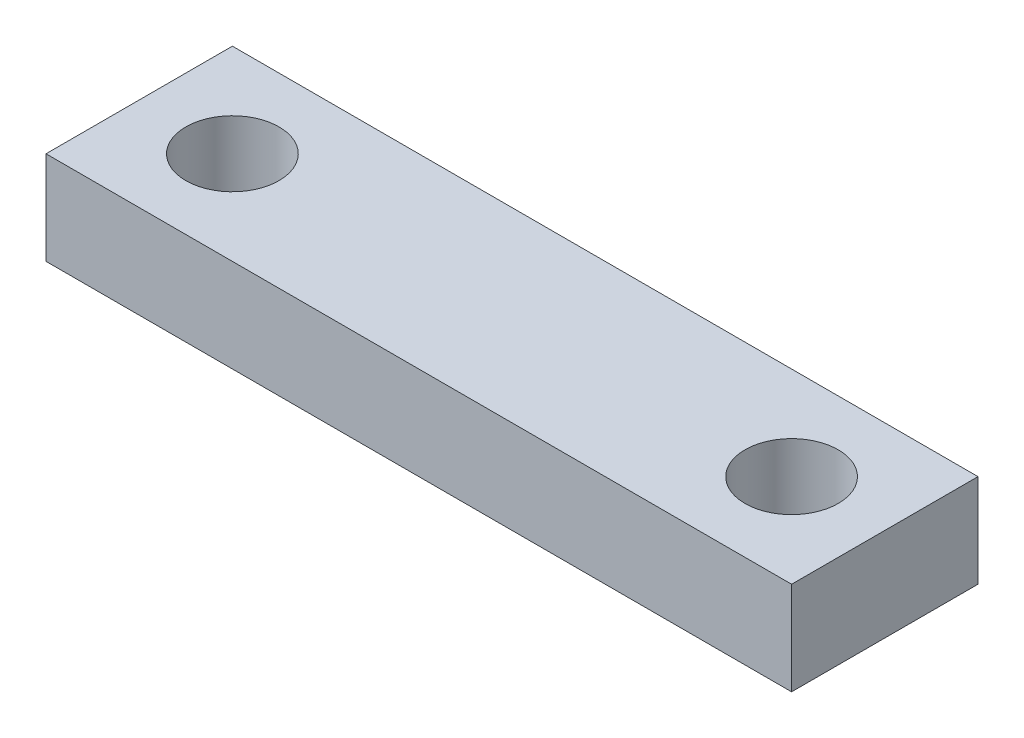
ISO-10303-21;
HEADER;
FILE_DESCRIPTION(('STEP AP214'),'2;1');
FILE_NAME('part.step','',(''),(''),'','','');
FILE_SCHEMA(('AUTOMOTIVE_DESIGN { 1 0 10303 214 1 1 1 1 }'));
ENDSEC;
DATA;
#1=APPLICATION_CONTEXT('core data for automotive mechanical design processes');
#2=APPLICATION_PROTOCOL_DEFINITION('international standard','automotive_design',2000,#1);
#3=PRODUCT_CONTEXT('',#1,'mechanical');
#4=PRODUCT('Part','Part','',(#3));
#5=PRODUCT_RELATED_PRODUCT_CATEGORY('part','',(#4));
#6=PRODUCT_DEFINITION_FORMATION('','',#4);
#7=PRODUCT_DEFINITION_CONTEXT('part definition',#1,'design');
#8=PRODUCT_DEFINITION('design','',#6,#7);
#9=PRODUCT_DEFINITION_SHAPE('','',#8);
#10=(LENGTH_UNIT() NAMED_UNIT(*) SI_UNIT(.MILLI.,.METRE.));
#11=(NAMED_UNIT(*) PLANE_ANGLE_UNIT() SI_UNIT($,.RADIAN.));
#12=(NAMED_UNIT(*) SI_UNIT($,.STERADIAN.) SOLID_ANGLE_UNIT());
#13=UNCERTAINTY_MEASURE_WITH_UNIT(LENGTH_MEASURE(1.E-05),#10,'distance_accuracy_value','');
#14=(GEOMETRIC_REPRESENTATION_CONTEXT(3) GLOBAL_UNCERTAINTY_ASSIGNED_CONTEXT((#13)) GLOBAL_UNIT_ASSIGNED_CONTEXT((#10,
#11,#12)) REPRESENTATION_CONTEXT('',''));
#15=CARTESIAN_POINT('',(0.,0.,0.));
#16=DIRECTION('',(0.,0.,1.));
#17=DIRECTION('',(1.,0.,0.));
#18=AXIS2_PLACEMENT_3D('',#15,#16,#17);
#19=CARTESIAN_POINT('',(0.,10.,0.));
#20=DIRECTION('',(0.,-1.,0.));
#21=DIRECTION('',(0.,0.,-1.));
#22=AXIS2_PLACEMENT_3D('',#19,#20,#21);
#23=PLANE('',#22);
#24=CARTESIAN_POINT('',(10.,10.,-10.));
#25=DIRECTION('',(0.,1.,0.));
#26=DIRECTION('',(0.,0.,1.));
#27=AXIS2_PLACEMENT_3D('',#24,#25,#26);
#28=CIRCLE('',#27,5.);
#29=CARTESIAN_POINT('',(10.,10.,-5.));
#30=VERTEX_POINT('',#29);
#31=EDGE_CURVE('E100',#30,#30,#28,.T.);
#32=ORIENTED_EDGE('',*,*,#31,.F.);
#33=EDGE_LOOP('',(#32));
#34=FACE_BOUND('',#33,.T.);
#35=DIRECTION('',(0.,0.,1.));
#36=VECTOR('',#35,1.);
#37=CARTESIAN_POINT('',(0.,10.,0.));
#38=LINE('',#37,#36);
#39=CARTESIAN_POINT('',(0.,10.,-20.));
#40=VERTEX_POINT('',#39);
#41=CARTESIAN_POINT('',(0.,10.,0.));
#42=VERTEX_POINT('',#41);
#43=EDGE_CURVE('E85',#40,#42,#38,.T.);
#44=ORIENTED_EDGE('',*,*,#43,.T.);
#45=DIRECTION('',(1.,0.,0.));
#46=VECTOR('',#45,1.);
#47=CARTESIAN_POINT('',(0.,10.,0.));
#48=LINE('',#47,#46);
#49=CARTESIAN_POINT('',(80.,10.,0.));
#50=VERTEX_POINT('',#49);
#51=EDGE_CURVE('E80',#42,#50,#48,.T.);
#52=ORIENTED_EDGE('',*,*,#51,.T.);
#53=DIRECTION('',(0.,0.,-1.));
#54=VECTOR('',#53,1.);
#55=CARTESIAN_POINT('',(80.,10.,0.));
#56=LINE('',#55,#54);
#57=CARTESIAN_POINT('',(80.,10.,-20.));
#58=VERTEX_POINT('',#57);
#59=EDGE_CURVE('E83',#50,#58,#56,.T.);
#60=ORIENTED_EDGE('',*,*,#59,.T.);
#61=DIRECTION('',(-1.,0.,0.));
#62=VECTOR('',#61,1.);
#63=CARTESIAN_POINT('',(0.,10.,-20.));
#64=LINE('',#63,#62);
#65=EDGE_CURVE('E50',#58,#40,#64,.T.);
#66=ORIENTED_EDGE('',*,*,#65,.T.);
#67=EDGE_LOOP('',(#44,#52,#60,#66));
#68=FACE_BOUND('',#67,.T.);
#69=CARTESIAN_POINT('',(70.,10.,-10.));
#70=DIRECTION('',(0.,1.,0.));
#71=DIRECTION('',(0.,0.,1.));
#72=AXIS2_PLACEMENT_3D('',#69,#70,#71);
#73=CIRCLE('',#72,5.);
#74=CARTESIAN_POINT('',(70.,10.,-5.));
#75=VERTEX_POINT('',#74);
#76=EDGE_CURVE('E115',#75,#75,#73,.T.);
#77=ORIENTED_EDGE('',*,*,#76,.F.);
#78=EDGE_LOOP('',(#77));
#79=FACE_BOUND('',#78,.T.);
#80=ADVANCED_FACE('F33',(#34,#68,#79),#23,.F.);
#81=CARTESIAN_POINT('',(0.,0.,0.));
#82=DIRECTION('',(0.,-1.,0.));
#83=DIRECTION('',(0.,0.,-1.));
#84=AXIS2_PLACEMENT_3D('',#81,#82,#83);
#85=PLANE('',#84);
#86=CARTESIAN_POINT('',(10.,0.,-10.));
#87=DIRECTION('',(0.,1.,0.));
#88=DIRECTION('',(0.,0.,1.));
#89=AXIS2_PLACEMENT_3D('',#86,#87,#88);
#90=CIRCLE('',#89,5.);
#91=CARTESIAN_POINT('',(10.,0.,-5.));
#92=VERTEX_POINT('',#91);
#93=EDGE_CURVE('E112',#92,#92,#90,.T.);
#94=ORIENTED_EDGE('',*,*,#93,.T.);
#95=EDGE_LOOP('',(#94));
#96=FACE_BOUND('',#95,.T.);
#97=DIRECTION('',(0.,0.,1.));
#98=VECTOR('',#97,1.);
#99=CARTESIAN_POINT('',(0.,0.,0.));
#100=LINE('',#99,#98);
#101=CARTESIAN_POINT('',(0.,0.,-20.));
#102=VERTEX_POINT('',#101);
#103=CARTESIAN_POINT('',(0.,0.,0.));
#104=VERTEX_POINT('',#103);
#105=EDGE_CURVE('E97',#102,#104,#100,.T.);
#106=ORIENTED_EDGE('',*,*,#105,.F.);
#107=DIRECTION('',(-1.,0.,0.));
#108=VECTOR('',#107,1.);
#109=CARTESIAN_POINT('',(0.,0.,-20.));
#110=LINE('',#109,#108);
#111=CARTESIAN_POINT('',(80.,0.,-20.));
#112=VERTEX_POINT('',#111);
#113=EDGE_CURVE('E73',#112,#102,#110,.T.);
#114=ORIENTED_EDGE('',*,*,#113,.F.);
#115=DIRECTION('',(0.,0.,-1.));
#116=VECTOR('',#115,1.);
#117=CARTESIAN_POINT('',(80.,0.,0.));
#118=LINE('',#117,#116);
#119=CARTESIAN_POINT('',(80.,0.,0.));
#120=VERTEX_POINT('',#119);
#121=EDGE_CURVE('E67',#120,#112,#118,.T.);
#122=ORIENTED_EDGE('',*,*,#121,.F.);
#123=DIRECTION('',(1.,0.,0.));
#124=VECTOR('',#123,1.);
#125=CARTESIAN_POINT('',(0.,0.,0.));
#126=LINE('',#125,#124);
#127=EDGE_CURVE('E89',#104,#120,#126,.T.);
#128=ORIENTED_EDGE('',*,*,#127,.F.);
#129=EDGE_LOOP('',(#106,#114,#122,#128));
#130=FACE_BOUND('',#129,.T.);
#131=CARTESIAN_POINT('',(70.,0.,-10.));
#132=DIRECTION('',(0.,1.,0.));
#133=DIRECTION('',(0.,0.,1.));
#134=AXIS2_PLACEMENT_3D('',#131,#132,#133);
#135=CIRCLE('',#134,5.);
#136=CARTESIAN_POINT('',(70.,0.,-5.));
#137=VERTEX_POINT('',#136);
#138=EDGE_CURVE('E118',#137,#137,#135,.T.);
#139=ORIENTED_EDGE('',*,*,#138,.T.);
#140=EDGE_LOOP('',(#139));
#141=FACE_BOUND('',#140,.T.);
#142=ADVANCED_FACE('F108',(#96,#130,#141),#85,.T.);
#143=CARTESIAN_POINT('',(0.,10.,0.));
#144=DIRECTION('',(1.,0.,0.));
#145=DIRECTION('',(0.,0.,-1.));
#146=AXIS2_PLACEMENT_3D('',#143,#144,#145);
#147=PLANE('',#146);
#148=ORIENTED_EDGE('',*,*,#105,.T.);
#149=DIRECTION('',(0.,-1.,0.));
#150=VECTOR('',#149,1.);
#151=CARTESIAN_POINT('',(0.,10.,0.));
#152=LINE('',#151,#150);
#153=EDGE_CURVE('E11',#42,#104,#152,.T.);
#154=ORIENTED_EDGE('',*,*,#153,.F.);
#155=ORIENTED_EDGE('',*,*,#43,.F.);
#156=DIRECTION('',(0.,-1.,0.));
#157=VECTOR('',#156,1.);
#158=CARTESIAN_POINT('',(0.,10.,-20.));
#159=LINE('',#158,#157);
#160=EDGE_CURVE('E93',#40,#102,#159,.T.);
#161=ORIENTED_EDGE('',*,*,#160,.T.);
#162=EDGE_LOOP('',(#148,#154,#155,#161));
#163=FACE_BOUND('',#162,.T.);
#164=ADVANCED_FACE('F35',(#163),#147,.F.);
#165=CARTESIAN_POINT('',(0.,10.,0.));
#166=DIRECTION('',(0.,0.,-1.));
#167=DIRECTION('',(-1.,0.,0.));
#168=AXIS2_PLACEMENT_3D('',#165,#166,#167);
#169=PLANE('',#168);
#170=ORIENTED_EDGE('',*,*,#127,.T.);
#171=DIRECTION('',(0.,-1.,0.));
#172=VECTOR('',#171,1.);
#173=CARTESIAN_POINT('',(80.,10.,0.));
#174=LINE('',#173,#172);
#175=EDGE_CURVE('E42',#50,#120,#174,.T.);
#176=ORIENTED_EDGE('',*,*,#175,.F.);
#177=ORIENTED_EDGE('',*,*,#51,.F.);
#178=ORIENTED_EDGE('',*,*,#153,.T.);
#179=EDGE_LOOP('',(#170,#176,#177,#178));
#180=FACE_BOUND('',#179,.T.);
#181=ADVANCED_FACE('F88',(#180),#169,.F.);
#182=CARTESIAN_POINT('',(80.,10.,0.));
#183=DIRECTION('',(-1.,0.,0.));
#184=DIRECTION('',(0.,0.,1.));
#185=AXIS2_PLACEMENT_3D('',#182,#183,#184);
#186=PLANE('',#185);
#187=ORIENTED_EDGE('',*,*,#121,.T.);
#188=DIRECTION('',(0.,-1.,0.));
#189=VECTOR('',#188,1.);
#190=CARTESIAN_POINT('',(80.,10.,-20.));
#191=LINE('',#190,#189);
#192=EDGE_CURVE('E90',#58,#112,#191,.T.);
#193=ORIENTED_EDGE('',*,*,#192,.F.);
#194=ORIENTED_EDGE('',*,*,#59,.F.);
#195=ORIENTED_EDGE('',*,*,#175,.T.);
#196=EDGE_LOOP('',(#187,#193,#194,#195));
#197=FACE_BOUND('',#196,.T.);
#198=ADVANCED_FACE('F91',(#197),#186,.F.);
#199=CARTESIAN_POINT('',(0.,10.,-20.));
#200=DIRECTION('',(0.,0.,1.));
#201=DIRECTION('',(1.,0.,0.));
#202=AXIS2_PLACEMENT_3D('',#199,#200,#201);
#203=PLANE('',#202);
#204=ORIENTED_EDGE('',*,*,#113,.T.);
#205=ORIENTED_EDGE('',*,*,#160,.F.);
#206=ORIENTED_EDGE('',*,*,#65,.F.);
#207=ORIENTED_EDGE('',*,*,#192,.T.);
#208=EDGE_LOOP('',(#204,#205,#206,#207));
#209=FACE_BOUND('',#208,.T.);
#210=ADVANCED_FACE('F105',(#209),#203,.F.);
#211=CARTESIAN_POINT('',(10.,10.,-10.));
#212=DIRECTION('',(0.,-1.,0.));
#213=DIRECTION('',(0.,0.,-1.));
#214=AXIS2_PLACEMENT_3D('',#211,#212,#213);
#215=CYLINDRICAL_SURFACE('',#214,5.);
#216=ORIENTED_EDGE('',*,*,#31,.T.);
#217=EDGE_LOOP('',(#216));
#218=FACE_BOUND('',#217,.T.);
#219=ORIENTED_EDGE('',*,*,#93,.F.);
#220=EDGE_LOOP('',(#219));
#221=FACE_BOUND('',#220,.T.);
#222=ADVANCED_FACE('F136',(#218,#221),#215,.F.);
#223=CARTESIAN_POINT('',(70.,10.,-10.));
#224=DIRECTION('',(0.,-1.,0.));
#225=DIRECTION('',(0.,0.,-1.));
#226=AXIS2_PLACEMENT_3D('',#223,#224,#225);
#227=CYLINDRICAL_SURFACE('',#226,5.);
#228=ORIENTED_EDGE('',*,*,#76,.T.);
#229=EDGE_LOOP('',(#228));
#230=FACE_BOUND('',#229,.T.);
#231=ORIENTED_EDGE('',*,*,#138,.F.);
#232=EDGE_LOOP('',(#231));
#233=FACE_BOUND('',#232,.T.);
#234=ADVANCED_FACE('F124',(#230,#233),#227,.F.);
#235=CLOSED_SHELL('',(#80,#142,#164,#181,#198,#210,#222,#234));
#236=MANIFOLD_SOLID_BREP('B2',#235);
#237=ADVANCED_BREP_SHAPE_REPRESENTATION('',(#18,#236),#14);
#238=SHAPE_DEFINITION_REPRESENTATION(#9,#237);
ENDSEC;
END-ISO-10303-21;
